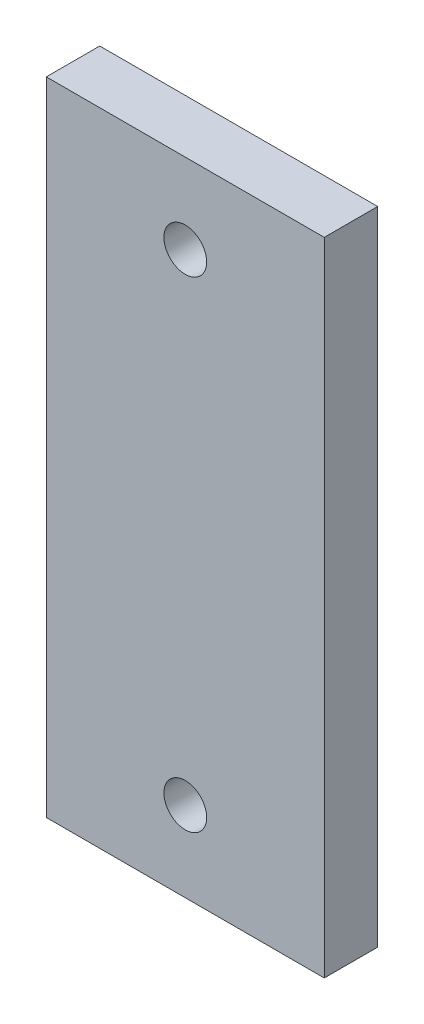
ISO-10303-21;
HEADER;
FILE_DESCRIPTION(('STEP AP214'),'2;1');
FILE_NAME('part.step','',(''),(''),'','','');
FILE_SCHEMA(('AUTOMOTIVE_DESIGN { 1 0 10303 214 1 1 1 1 }'));
ENDSEC;
DATA;
#1=APPLICATION_CONTEXT('core data for automotive mechanical design processes');
#2=APPLICATION_PROTOCOL_DEFINITION('international standard','automotive_design',2000,#1);
#3=PRODUCT_CONTEXT('',#1,'mechanical');
#4=PRODUCT('Part','Part','',(#3));
#5=PRODUCT_RELATED_PRODUCT_CATEGORY('part','',(#4));
#6=PRODUCT_DEFINITION_FORMATION('','',#4);
#7=PRODUCT_DEFINITION_CONTEXT('part definition',#1,'design');
#8=PRODUCT_DEFINITION('design','',#6,#7);
#9=PRODUCT_DEFINITION_SHAPE('','',#8);
#10=(LENGTH_UNIT() NAMED_UNIT(*) SI_UNIT(.MILLI.,.METRE.));
#11=(NAMED_UNIT(*) PLANE_ANGLE_UNIT() SI_UNIT($,.RADIAN.));
#12=(NAMED_UNIT(*) SI_UNIT($,.STERADIAN.) SOLID_ANGLE_UNIT());
#13=UNCERTAINTY_MEASURE_WITH_UNIT(LENGTH_MEASURE(1.E-05),#10,'distance_accuracy_value','');
#14=(GEOMETRIC_REPRESENTATION_CONTEXT(3) GLOBAL_UNCERTAINTY_ASSIGNED_CONTEXT((#13)) GLOBAL_UNIT_ASSIGNED_CONTEXT((#10,
#11,#12)) REPRESENTATION_CONTEXT('',''));
#15=CARTESIAN_POINT('',(0.,0.,0.));
#16=DIRECTION('',(0.,0.,1.));
#17=DIRECTION('',(1.,0.,0.));
#18=AXIS2_PLACEMENT_3D('',#15,#16,#17);
#19=CARTESIAN_POINT('',(0.,0.,5.));
#20=DIRECTION('',(0.,0.,-1.));
#21=DIRECTION('',(-1.,0.,0.));
#22=AXIS2_PLACEMENT_3D('',#19,#20,#21);
#23=PLANE('',#22);
#24=DIRECTION('',(0.,-1.,0.));
#25=VECTOR('',#24,1.);
#26=CARTESIAN_POINT('',(-37.4967291835125,-28.2336679674562,5.));
#27=LINE('',#26,#25);
#28=CARTESIAN_POINT('',(-37.4967291835125,31.7663320325438,5.));
#29=VERTEX_POINT('',#28);
#30=CARTESIAN_POINT('',(-37.4967291835125,-28.2336679674562,5.));
#31=VERTEX_POINT('',#30);
#32=EDGE_CURVE('E87',#29,#31,#27,.T.);
#33=ORIENTED_EDGE('',*,*,#32,.T.);
#34=DIRECTION('',(1.,0.,0.));
#35=VECTOR('',#34,1.);
#36=CARTESIAN_POINT('',(-11.4967291835125,-28.2336679674562,5.));
#37=LINE('',#36,#35);
#38=CARTESIAN_POINT('',(-11.4967291835125,-28.2336679674562,5.));
#39=VERTEX_POINT('',#38);
#40=EDGE_CURVE('E82',#31,#39,#37,.T.);
#41=ORIENTED_EDGE('',*,*,#40,.T.);
#42=DIRECTION('',(0.,1.,0.));
#43=VECTOR('',#42,1.);
#44=CARTESIAN_POINT('',(-11.4967291835125,31.7663320325438,5.));
#45=LINE('',#44,#43);
#46=CARTESIAN_POINT('',(-11.4967291835125,31.7663320325438,5.));
#47=VERTEX_POINT('',#46);
#48=EDGE_CURVE('E85',#39,#47,#45,.T.);
#49=ORIENTED_EDGE('',*,*,#48,.T.);
#50=DIRECTION('',(-1.,0.,0.));
#51=VECTOR('',#50,1.);
#52=CARTESIAN_POINT('',(-37.4967291835125,31.7663320325438,5.));
#53=LINE('',#52,#51);
#54=EDGE_CURVE('E52',#47,#29,#53,.T.);
#55=ORIENTED_EDGE('',*,*,#54,.T.);
#56=EDGE_LOOP('',(#33,#41,#49,#55));
#57=FACE_BOUND('',#56,.T.);
#58=CARTESIAN_POINT('',(-24.4967291835125,24.2663320325438,5.));
#59=DIRECTION('',(0.,0.,1.));
#60=DIRECTION('',(1.,0.,0.));
#61=AXIS2_PLACEMENT_3D('',#58,#59,#60);
#62=CIRCLE('',#61,2.);
#63=CARTESIAN_POINT('',(-22.4967291835125,24.2663320325438,5.));
#64=VERTEX_POINT('',#63);
#65=EDGE_CURVE('E102',#64,#64,#62,.T.);
#66=ORIENTED_EDGE('',*,*,#65,.F.);
#67=EDGE_LOOP('',(#66));
#68=FACE_BOUND('',#67,.T.);
#69=CARTESIAN_POINT('',(-24.4967291835125,-20.7336679674562,5.));
#70=DIRECTION('',(0.,0.,1.));
#71=DIRECTION('',(-1.,0.,0.));
#72=AXIS2_PLACEMENT_3D('',#69,#70,#71);
#73=CIRCLE('',#72,2.);
#74=CARTESIAN_POINT('',(-26.4967291835125,-20.7336679674562,5.));
#75=VERTEX_POINT('',#74);
#76=EDGE_CURVE('E117',#75,#75,#73,.T.);
#77=ORIENTED_EDGE('',*,*,#76,.F.);
#78=EDGE_LOOP('',(#77));
#79=FACE_BOUND('',#78,.T.);
#80=ADVANCED_FACE('F35',(#57,#68,#79),#23,.F.);
#81=CARTESIAN_POINT('',(0.,0.,0.));
#82=DIRECTION('',(0.,0.,-1.));
#83=DIRECTION('',(-1.,0.,0.));
#84=AXIS2_PLACEMENT_3D('',#81,#82,#83);
#85=PLANE('',#84);
#86=CARTESIAN_POINT('',(-24.4967291835125,24.2663320325438,0.));
#87=DIRECTION('',(0.,0.,1.));
#88=DIRECTION('',(1.,0.,0.));
#89=AXIS2_PLACEMENT_3D('',#86,#87,#88);
#90=CIRCLE('',#89,2.);
#91=CARTESIAN_POINT('',(-22.4967291835125,24.2663320325438,0.));
#92=VERTEX_POINT('',#91);
#93=EDGE_CURVE('E114',#92,#92,#90,.T.);
#94=ORIENTED_EDGE('',*,*,#93,.T.);
#95=EDGE_LOOP('',(#94));
#96=FACE_BOUND('',#95,.T.);
#97=DIRECTION('',(0.,-1.,0.));
#98=VECTOR('',#97,1.);
#99=CARTESIAN_POINT('',(-37.4967291835125,-28.2336679674562,0.));
#100=LINE('',#99,#98);
#101=CARTESIAN_POINT('',(-37.4967291835125,31.7663320325438,0.));
#102=VERTEX_POINT('',#101);
#103=CARTESIAN_POINT('',(-37.4967291835125,-28.2336679674562,0.));
#104=VERTEX_POINT('',#103);
#105=EDGE_CURVE('E99',#102,#104,#100,.T.);
#106=ORIENTED_EDGE('',*,*,#105,.F.);
#107=DIRECTION('',(-1.,0.,0.));
#108=VECTOR('',#107,1.);
#109=CARTESIAN_POINT('',(-37.4967291835125,31.7663320325438,0.));
#110=LINE('',#109,#108);
#111=CARTESIAN_POINT('',(-11.4967291835125,31.7663320325438,0.));
#112=VERTEX_POINT('',#111);
#113=EDGE_CURVE('E75',#112,#102,#110,.T.);
#114=ORIENTED_EDGE('',*,*,#113,.F.);
#115=DIRECTION('',(0.,1.,0.));
#116=VECTOR('',#115,1.);
#117=CARTESIAN_POINT('',(-11.4967291835125,31.7663320325438,0.));
#118=LINE('',#117,#116);
#119=CARTESIAN_POINT('',(-11.4967291835125,-28.2336679674562,0.));
#120=VERTEX_POINT('',#119);
#121=EDGE_CURVE('E69',#120,#112,#118,.T.);
#122=ORIENTED_EDGE('',*,*,#121,.F.);
#123=DIRECTION('',(1.,0.,0.));
#124=VECTOR('',#123,1.);
#125=CARTESIAN_POINT('',(-11.4967291835125,-28.2336679674562,0.));
#126=LINE('',#125,#124);
#127=EDGE_CURVE('E91',#104,#120,#126,.T.);
#128=ORIENTED_EDGE('',*,*,#127,.F.);
#129=EDGE_LOOP('',(#106,#114,#122,#128));
#130=FACE_BOUND('',#129,.T.);
#131=CARTESIAN_POINT('',(-24.4967291835125,-20.7336679674562,0.));
#132=DIRECTION('',(0.,0.,1.));
#133=DIRECTION('',(-1.,0.,0.));
#134=AXIS2_PLACEMENT_3D('',#131,#132,#133);
#135=CIRCLE('',#134,2.);
#136=CARTESIAN_POINT('',(-26.4967291835125,-20.7336679674562,0.));
#137=VERTEX_POINT('',#136);
#138=EDGE_CURVE('E120',#137,#137,#135,.T.);
#139=ORIENTED_EDGE('',*,*,#138,.T.);
#140=EDGE_LOOP('',(#139));
#141=FACE_BOUND('',#140,.T.);
#142=ADVANCED_FACE('F110',(#96,#130,#141),#85,.T.);
#143=CARTESIAN_POINT('',(-37.4967291835125,-28.2336679674562,5.));
#144=DIRECTION('',(1.,0.,0.));
#145=DIRECTION('',(0.,0.,-1.));
#146=AXIS2_PLACEMENT_3D('',#143,#144,#145);
#147=PLANE('',#146);
#148=ORIENTED_EDGE('',*,*,#105,.T.);
#149=DIRECTION('',(0.,0.,-1.));
#150=VECTOR('',#149,1.);
#151=CARTESIAN_POINT('',(-37.4967291835125,-28.2336679674562,5.));
#152=LINE('',#151,#150);
#153=EDGE_CURVE('E11',#31,#104,#152,.T.);
#154=ORIENTED_EDGE('',*,*,#153,.F.);
#155=ORIENTED_EDGE('',*,*,#32,.F.);
#156=DIRECTION('',(0.,0.,-1.));
#157=VECTOR('',#156,1.);
#158=CARTESIAN_POINT('',(-37.4967291835125,31.7663320325438,5.));
#159=LINE('',#158,#157);
#160=EDGE_CURVE('E95',#29,#102,#159,.T.);
#161=ORIENTED_EDGE('',*,*,#160,.T.);
#162=EDGE_LOOP('',(#148,#154,#155,#161));
#163=FACE_BOUND('',#162,.T.);
#164=ADVANCED_FACE('F37',(#163),#147,.F.);
#165=CARTESIAN_POINT('',(-11.4967291835125,-28.2336679674562,5.));
#166=DIRECTION('',(0.,1.,0.));
#167=DIRECTION('',(0.,0.,1.));
#168=AXIS2_PLACEMENT_3D('',#165,#166,#167);
#169=PLANE('',#168);
#170=ORIENTED_EDGE('',*,*,#127,.T.);
#171=DIRECTION('',(0.,0.,-1.));
#172=VECTOR('',#171,1.);
#173=CARTESIAN_POINT('',(-11.4967291835125,-28.2336679674562,5.));
#174=LINE('',#173,#172);
#175=EDGE_CURVE('E44',#39,#120,#174,.T.);
#176=ORIENTED_EDGE('',*,*,#175,.F.);
#177=ORIENTED_EDGE('',*,*,#40,.F.);
#178=ORIENTED_EDGE('',*,*,#153,.T.);
#179=EDGE_LOOP('',(#170,#176,#177,#178));
#180=FACE_BOUND('',#179,.T.);
#181=ADVANCED_FACE('F90',(#180),#169,.F.);
#182=CARTESIAN_POINT('',(-11.4967291835125,31.7663320325438,5.));
#183=DIRECTION('',(-1.,0.,0.));
#184=DIRECTION('',(0.,0.,1.));
#185=AXIS2_PLACEMENT_3D('',#182,#183,#184);
#186=PLANE('',#185);
#187=ORIENTED_EDGE('',*,*,#121,.T.);
#188=DIRECTION('',(0.,0.,-1.));
#189=VECTOR('',#188,1.);
#190=CARTESIAN_POINT('',(-11.4967291835125,31.7663320325438,5.));
#191=LINE('',#190,#189);
#192=EDGE_CURVE('E92',#47,#112,#191,.T.);
#193=ORIENTED_EDGE('',*,*,#192,.F.);
#194=ORIENTED_EDGE('',*,*,#48,.F.);
#195=ORIENTED_EDGE('',*,*,#175,.T.);
#196=EDGE_LOOP('',(#187,#193,#194,#195));
#197=FACE_BOUND('',#196,.T.);
#198=ADVANCED_FACE('F93',(#197),#186,.F.);
#199=CARTESIAN_POINT('',(-37.4967291835125,31.7663320325438,5.));
#200=DIRECTION('',(0.,-1.,0.));
#201=DIRECTION('',(0.,0.,-1.));
#202=AXIS2_PLACEMENT_3D('',#199,#200,#201);
#203=PLANE('',#202);
#204=ORIENTED_EDGE('',*,*,#113,.T.);
#205=ORIENTED_EDGE('',*,*,#160,.F.);
#206=ORIENTED_EDGE('',*,*,#54,.F.);
#207=ORIENTED_EDGE('',*,*,#192,.T.);
#208=EDGE_LOOP('',(#204,#205,#206,#207));
#209=FACE_BOUND('',#208,.T.);
#210=ADVANCED_FACE('F107',(#209),#203,.F.);
#211=CARTESIAN_POINT('',(-24.4967291835125,24.2663320325438,5.));
#212=DIRECTION('',(0.,0.,-1.));
#213=DIRECTION('',(-1.,0.,0.));
#214=AXIS2_PLACEMENT_3D('',#211,#212,#213);
#215=CYLINDRICAL_SURFACE('',#214,2.);
#216=ORIENTED_EDGE('',*,*,#65,.T.);
#217=EDGE_LOOP('',(#216));
#218=FACE_BOUND('',#217,.T.);
#219=ORIENTED_EDGE('',*,*,#93,.F.);
#220=EDGE_LOOP('',(#219));
#221=FACE_BOUND('',#220,.T.);
#222=ADVANCED_FACE('F137',(#218,#221),#215,.F.);
#223=CARTESIAN_POINT('',(-24.4967291835125,-20.7336679674562,5.));
#224=DIRECTION('',(0.,0.,-1.));
#225=DIRECTION('',(-1.,0.,0.));
#226=AXIS2_PLACEMENT_3D('',#223,#224,#225);
#227=CYLINDRICAL_SURFACE('',#226,2.);
#228=ORIENTED_EDGE('',*,*,#76,.T.);
#229=EDGE_LOOP('',(#228));
#230=FACE_BOUND('',#229,.T.);
#231=ORIENTED_EDGE('',*,*,#138,.F.);
#232=EDGE_LOOP('',(#231));
#233=FACE_BOUND('',#232,.T.);
#234=ADVANCED_FACE('F126',(#230,#233),#227,.F.);
#235=CLOSED_SHELL('',(#80,#142,#164,#181,#198,#210,#222,#234));
#236=MANIFOLD_SOLID_BREP('B2',#235);
#237=ADVANCED_BREP_SHAPE_REPRESENTATION('',(#18,#236),#14);
#238=SHAPE_DEFINITION_REPRESENTATION(#9,#237);
ENDSEC;
END-ISO-10303-21;
